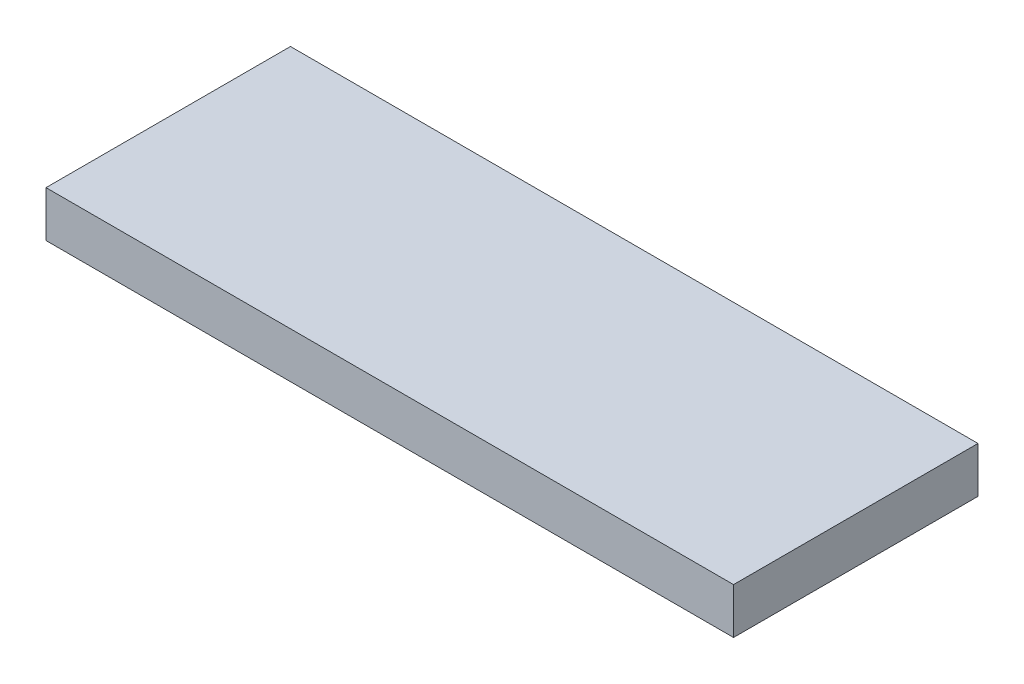
ISO-10303-21;
HEADER;
FILE_DESCRIPTION(('STEP AP214'),'2;1');
FILE_NAME('part.step','',(''),(''),'','','');
FILE_SCHEMA(('AUTOMOTIVE_DESIGN { 1 0 10303 214 1 1 1 1 }'));
ENDSEC;
DATA;
#1=APPLICATION_CONTEXT('core data for automotive mechanical design processes');
#2=APPLICATION_PROTOCOL_DEFINITION('international standard','automotive_design',2000,#1);
#3=PRODUCT_CONTEXT('',#1,'mechanical');
#4=PRODUCT('Part','Part','',(#3));
#5=PRODUCT_RELATED_PRODUCT_CATEGORY('part','',(#4));
#6=PRODUCT_DEFINITION_FORMATION('','',#4);
#7=PRODUCT_DEFINITION_CONTEXT('part definition',#1,'design');
#8=PRODUCT_DEFINITION('design','',#6,#7);
#9=PRODUCT_DEFINITION_SHAPE('','',#8);
#10=(LENGTH_UNIT() NAMED_UNIT(*) SI_UNIT(.MILLI.,.METRE.));
#11=(NAMED_UNIT(*) PLANE_ANGLE_UNIT() SI_UNIT($,.RADIAN.));
#12=(NAMED_UNIT(*) SI_UNIT($,.STERADIAN.) SOLID_ANGLE_UNIT());
#13=UNCERTAINTY_MEASURE_WITH_UNIT(LENGTH_MEASURE(1.E-05),#10,'distance_accuracy_value','');
#14=(GEOMETRIC_REPRESENTATION_CONTEXT(3) GLOBAL_UNCERTAINTY_ASSIGNED_CONTEXT((#13)) GLOBAL_UNIT_ASSIGNED_CONTEXT((#10,
#11,#12)) REPRESENTATION_CONTEXT('',''));
#15=CARTESIAN_POINT('',(0.,0.,0.));
#16=DIRECTION('',(0.,0.,1.));
#17=DIRECTION('',(1.,0.,0.));
#18=AXIS2_PLACEMENT_3D('',#15,#16,#17);
#19=CARTESIAN_POINT('',(-92.8858818175925,19.05,-37.6722913984374));
#20=DIRECTION('',(1.,0.,0.));
#21=DIRECTION('',(0.,0.,-1.));
#22=AXIS2_PLACEMENT_3D('',#19,#20,#21);
#23=PLANE('',#22);
#24=DIRECTION('',(0.,0.,1.));
#25=VECTOR('',#24,1.);
#26=CARTESIAN_POINT('',(-92.8858818175925,0.,-37.6722913984374));
#27=LINE('',#26,#25);
#28=CARTESIAN_POINT('',(-92.8858818175925,0.,-37.6722913984374));
#29=VERTEX_POINT('',#28);
#30=CARTESIAN_POINT('',(-92.8858818175925,0.,63.9277086015626));
#31=VERTEX_POINT('',#30);
#32=EDGE_CURVE('E107',#29,#31,#27,.T.);
#33=ORIENTED_EDGE('',*,*,#32,.T.);
#34=DIRECTION('',(0.,-1.,0.));
#35=VECTOR('',#34,1.);
#36=CARTESIAN_POINT('',(-92.8858818175925,19.05,63.9277086015626));
#37=LINE('',#36,#35);
#38=CARTESIAN_POINT('',(-92.8858818175925,19.05,63.9277086015626));
#39=VERTEX_POINT('',#38);
#40=EDGE_CURVE('E11',#39,#31,#37,.T.);
#41=ORIENTED_EDGE('',*,*,#40,.F.);
#42=DIRECTION('',(0.,0.,1.));
#43=VECTOR('',#42,1.);
#44=CARTESIAN_POINT('',(-92.8858818175925,19.05,-37.6722913984374));
#45=LINE('',#44,#43);
#46=CARTESIAN_POINT('',(-92.8858818175925,19.05,-37.6722913984374));
#47=VERTEX_POINT('',#46);
#48=EDGE_CURVE('E91',#47,#39,#45,.T.);
#49=ORIENTED_EDGE('',*,*,#48,.F.);
#50=DIRECTION('',(0.,-1.,0.));
#51=VECTOR('',#50,1.);
#52=CARTESIAN_POINT('',(-92.8858818175925,19.05,-37.6722913984374));
#53=LINE('',#52,#51);
#54=EDGE_CURVE('E103',#47,#29,#53,.T.);
#55=ORIENTED_EDGE('',*,*,#54,.T.);
#56=EDGE_LOOP('',(#33,#41,#49,#55));
#57=FACE_BOUND('',#56,.T.);
#58=ADVANCED_FACE('F39',(#57),#23,.F.);
#59=CARTESIAN_POINT('',(-92.8858818175925,19.05,63.9277086015626));
#60=DIRECTION('',(0.,0.,-1.));
#61=DIRECTION('',(-1.,0.,0.));
#62=AXIS2_PLACEMENT_3D('',#59,#60,#61);
#63=PLANE('',#62);
#64=DIRECTION('',(1.,0.,0.));
#65=VECTOR('',#64,1.);
#66=CARTESIAN_POINT('',(-92.8858818175925,0.,63.9277086015626));
#67=LINE('',#66,#65);
#68=CARTESIAN_POINT('',(192.864118182408,0.,63.9277086015626));
#69=VERTEX_POINT('',#68);
#70=EDGE_CURVE('E96',#31,#69,#67,.T.);
#71=ORIENTED_EDGE('',*,*,#70,.T.);
#72=DIRECTION('',(0.,-1.,0.));
#73=VECTOR('',#72,1.);
#74=CARTESIAN_POINT('',(192.864118182408,19.05,63.9277086015626));
#75=LINE('',#74,#73);
#76=CARTESIAN_POINT('',(192.864118182408,19.05,63.9277086015626));
#77=VERTEX_POINT('',#76);
#78=EDGE_CURVE('E48',#77,#69,#75,.T.);
#79=ORIENTED_EDGE('',*,*,#78,.F.);
#80=DIRECTION('',(1.,0.,0.));
#81=VECTOR('',#80,1.);
#82=CARTESIAN_POINT('',(-92.8858818175925,19.05,63.9277086015626));
#83=LINE('',#82,#81);
#84=EDGE_CURVE('E86',#39,#77,#83,.T.);
#85=ORIENTED_EDGE('',*,*,#84,.F.);
#86=ORIENTED_EDGE('',*,*,#40,.T.);
#87=EDGE_LOOP('',(#71,#79,#85,#86));
#88=FACE_BOUND('',#87,.T.);
#89=ADVANCED_FACE('F95',(#88),#63,.F.);
#90=CARTESIAN_POINT('',(192.864118182407,19.05,-37.6722913984374));
#91=DIRECTION('',(-1.,0.,0.));
#92=DIRECTION('',(0.,0.,1.));
#93=AXIS2_PLACEMENT_3D('',#90,#91,#92);
#94=PLANE('',#93);
#95=DIRECTION('',(0.,0.,-1.));
#96=VECTOR('',#95,1.);
#97=CARTESIAN_POINT('',(192.864118182407,0.,-37.6722913984374));
#98=LINE('',#97,#96);
#99=CARTESIAN_POINT('',(192.864118182407,0.,-37.6722913984374));
#100=VERTEX_POINT('',#99);
#101=EDGE_CURVE('E73',#69,#100,#98,.T.);
#102=ORIENTED_EDGE('',*,*,#101,.T.);
#103=DIRECTION('',(0.,-1.,0.));
#104=VECTOR('',#103,1.);
#105=CARTESIAN_POINT('',(192.864118182407,19.05,-37.6722913984374));
#106=LINE('',#105,#104);
#107=CARTESIAN_POINT('',(192.864118182407,19.05,-37.6722913984374));
#108=VERTEX_POINT('',#107);
#109=EDGE_CURVE('E98',#108,#100,#106,.T.);
#110=ORIENTED_EDGE('',*,*,#109,.F.);
#111=DIRECTION('',(0.,0.,-1.));
#112=VECTOR('',#111,1.);
#113=CARTESIAN_POINT('',(192.864118182407,19.05,-37.6722913984374));
#114=LINE('',#113,#112);
#115=EDGE_CURVE('E89',#77,#108,#114,.T.);
#116=ORIENTED_EDGE('',*,*,#115,.F.);
#117=ORIENTED_EDGE('',*,*,#78,.T.);
#118=EDGE_LOOP('',(#102,#110,#116,#117));
#119=FACE_BOUND('',#118,.T.);
#120=ADVANCED_FACE('F99',(#119),#94,.F.);
#121=CARTESIAN_POINT('',(-92.8858818175925,19.05,-37.6722913984374));
#122=DIRECTION('',(0.,0.,1.));
#123=DIRECTION('',(1.,0.,0.));
#124=AXIS2_PLACEMENT_3D('',#121,#122,#123);
#125=PLANE('',#124);
#126=DIRECTION('',(-1.,0.,0.));
#127=VECTOR('',#126,1.);
#128=CARTESIAN_POINT('',(-92.8858818175925,0.,-37.6722913984374));
#129=LINE('',#128,#127);
#130=EDGE_CURVE('E79',#100,#29,#129,.T.);
#131=ORIENTED_EDGE('',*,*,#130,.T.);
#132=ORIENTED_EDGE('',*,*,#54,.F.);
#133=DIRECTION('',(-1.,0.,0.));
#134=VECTOR('',#133,1.);
#135=CARTESIAN_POINT('',(-92.8858818175925,19.05,-37.6722913984374));
#136=LINE('',#135,#134);
#137=EDGE_CURVE('E56',#108,#47,#136,.T.);
#138=ORIENTED_EDGE('',*,*,#137,.F.);
#139=ORIENTED_EDGE('',*,*,#109,.T.);
#140=EDGE_LOOP('',(#131,#132,#138,#139));
#141=FACE_BOUND('',#140,.T.);
#142=ADVANCED_FACE('F120',(#141),#125,.F.);
#143=CARTESIAN_POINT('',(0.,19.05,0.));
#144=DIRECTION('',(0.,1.,0.));
#145=DIRECTION('',(0.,0.,1.));
#146=AXIS2_PLACEMENT_3D('',#143,#144,#145);
#147=PLANE('',#146);
#148=ORIENTED_EDGE('',*,*,#48,.T.);
#149=ORIENTED_EDGE('',*,*,#84,.T.);
#150=ORIENTED_EDGE('',*,*,#115,.T.);
#151=ORIENTED_EDGE('',*,*,#137,.T.);
#152=EDGE_LOOP('',(#148,#149,#150,#151));
#153=FACE_BOUND('',#152,.T.);
#154=ADVANCED_FACE('F87',(#153),#147,.T.);
#155=CARTESIAN_POINT('',(0.,0.,0.));
#156=DIRECTION('',(0.,1.,0.));
#157=DIRECTION('',(0.,0.,1.));
#158=AXIS2_PLACEMENT_3D('',#155,#156,#157);
#159=PLANE('',#158);
#160=ORIENTED_EDGE('',*,*,#32,.F.);
#161=ORIENTED_EDGE('',*,*,#130,.F.);
#162=ORIENTED_EDGE('',*,*,#101,.F.);
#163=ORIENTED_EDGE('',*,*,#70,.F.);
#164=EDGE_LOOP('',(#160,#161,#162,#163));
#165=FACE_BOUND('',#164,.T.);
#166=ADVANCED_FACE('F123',(#165),#159,.F.);
#167=CLOSED_SHELL('',(#58,#89,#120,#142,#154,#166));
#168=MANIFOLD_SOLID_BREP('B2',#167);
#169=ADVANCED_BREP_SHAPE_REPRESENTATION('',(#18,#168),#14);
#170=SHAPE_DEFINITION_REPRESENTATION(#9,#169);
ENDSEC;
END-ISO-10303-21;
